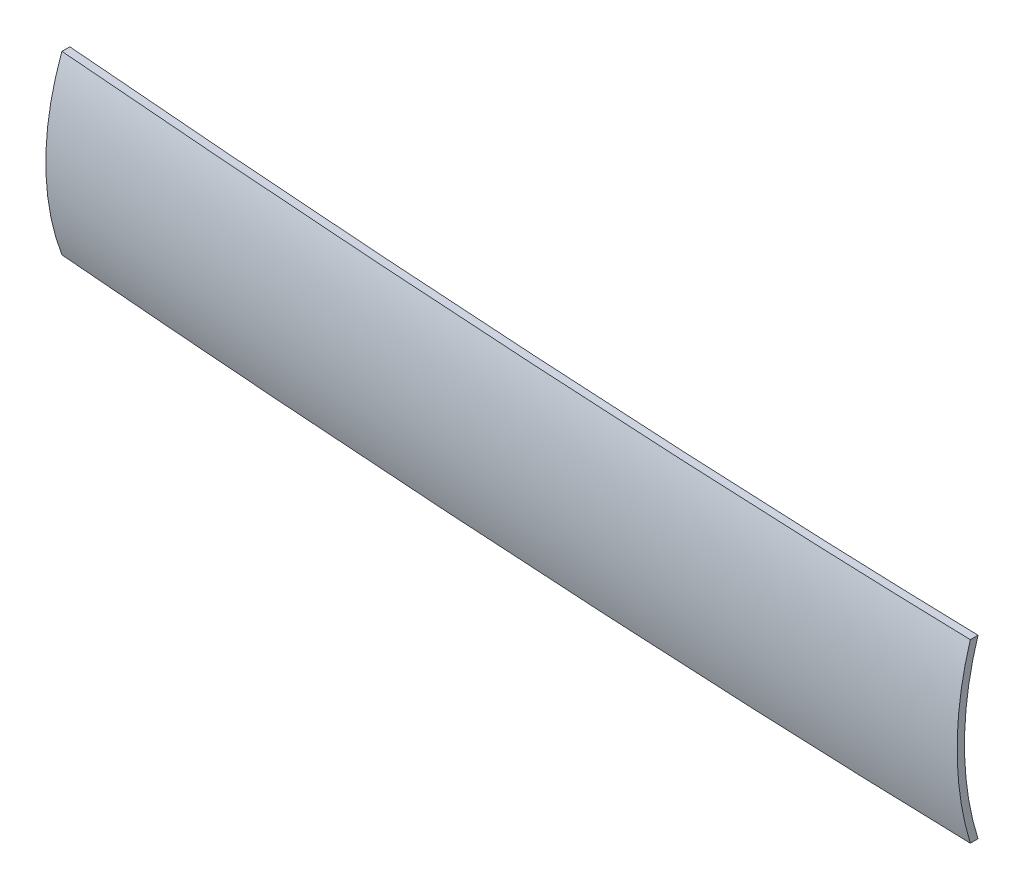
ISO-10303-21;
HEADER;
FILE_DESCRIPTION(('STEP AP214'),'2;1');
FILE_NAME('part.step','',(''),(''),'','','');
FILE_SCHEMA(('AUTOMOTIVE_DESIGN { 1 0 10303 214 1 1 1 1 }'));
ENDSEC;
DATA;
#1=APPLICATION_CONTEXT('core data for automotive mechanical design processes');
#2=APPLICATION_PROTOCOL_DEFINITION('international standard','automotive_design',2000,#1);
#3=PRODUCT_CONTEXT('',#1,'mechanical');
#4=PRODUCT('Part','Part','',(#3));
#5=PRODUCT_RELATED_PRODUCT_CATEGORY('part','',(#4));
#6=PRODUCT_DEFINITION_FORMATION('','',#4);
#7=PRODUCT_DEFINITION_CONTEXT('part definition',#1,'design');
#8=PRODUCT_DEFINITION('design','',#6,#7);
#9=PRODUCT_DEFINITION_SHAPE('','',#8);
#10=(LENGTH_UNIT() NAMED_UNIT(*) SI_UNIT(.MILLI.,.METRE.));
#11=(NAMED_UNIT(*) PLANE_ANGLE_UNIT() SI_UNIT($,.RADIAN.));
#12=(NAMED_UNIT(*) SI_UNIT($,.STERADIAN.) SOLID_ANGLE_UNIT());
#13=UNCERTAINTY_MEASURE_WITH_UNIT(LENGTH_MEASURE(1.E-05),#10,'distance_accuracy_value','');
#14=(GEOMETRIC_REPRESENTATION_CONTEXT(3) GLOBAL_UNCERTAINTY_ASSIGNED_CONTEXT((#13)) GLOBAL_UNIT_ASSIGNED_CONTEXT((#10,
#11,#12)) REPRESENTATION_CONTEXT('',''));
#15=CARTESIAN_POINT('',(0.,0.,0.));
#16=DIRECTION('',(0.,0.,1.));
#17=DIRECTION('',(1.,0.,0.));
#18=AXIS2_PLACEMENT_3D('',#15,#16,#17);
#19=CARTESIAN_POINT('',(406.4,-19.05,-65.415));
#20=DIRECTION('',(0.,-1.,0.));
#21=DIRECTION('',(0.,0.,-1.));
#22=AXIS2_PLACEMENT_3D('',#19,#20,#21);
#23=PLANE('',#22);
#24=DIRECTION('',(0.,0.,1.));
#25=VECTOR('',#24,1.);
#26=CARTESIAN_POINT('',(614.68,-19.05,-65.415));
#27=LINE('',#26,#25);
#28=CARTESIAN_POINT('',(614.68,-19.05,60.5768706545498));
#29=VERTEX_POINT('',#28);
#30=CARTESIAN_POINT('',(614.68,-19.05,62.2394634164212));
#31=VERTEX_POINT('',#30);
#32=EDGE_CURVE('E82',#29,#31,#27,.T.);
#33=ORIENTED_EDGE('',*,*,#32,.T.);
#34=CARTESIAN_POINT('',(614.68,-19.05,62.2394634164212));
#35=CARTESIAN_POINT('',(613.632020687048,-19.05,62.214036244445));
#36=CARTESIAN_POINT('',(612.584065275247,-19.05,62.1876407135079));
#37=CARTESIAN_POINT('',(610.488201738093,-19.05,62.133050106058));
#38=CARTESIAN_POINT('',(609.440293612721,-19.05,62.104855030323));
#39=CARTESIAN_POINT('',(606.296642502465,-19.05,62.0177763337339));
#40=CARTESIAN_POINT('',(604.200968314201,-19.05,61.9563991338882));
#41=CARTESIAN_POINT('',(600.009890101021,-19.05,61.8276867697237));
#42=CARTESIAN_POINT('',(597.914486068537,-19.05,61.7603518507096));
#43=CARTESIAN_POINT('',(593.723861333019,-19.05,61.6201826347736));
#44=CARTESIAN_POINT('',(591.628640630094,-19.05,61.5473483346516));
#45=CARTESIAN_POINT('',(585.343330166874,-19.05,61.321240195689));
#46=CARTESIAN_POINT('',(581.153512665783,-19.05,61.1603586471973));
#47=CARTESIAN_POINT('',(572.77463031861,-19.05,60.8207552047305));
#48=CARTESIAN_POINT('',(568.585565468283,-19.05,60.6420334147609));
#49=CARTESIAN_POINT('',(560.2081584473,-19.05,60.2683996980428));
#50=CARTESIAN_POINT('',(556.019816276736,-19.05,60.0734877692279));
#51=CARTESIAN_POINT('',(547.644715412293,-19.05,59.6686940681309));
#52=CARTESIAN_POINT('',(543.457956569752,-19.05,59.4588153655638));
#53=CARTESIAN_POINT('',(535.085138225165,-19.05,59.0250347291512));
#54=CARTESIAN_POINT('',(530.899078727991,-19.05,58.8011327013992));
#55=CARTESIAN_POINT('',(522.527669629884,-19.05,58.3400535932044));
#56=CARTESIAN_POINT('',(518.342320032775,-19.05,58.1028764434133));
#57=CARTESIAN_POINT('',(509.972351894087,-19.05,57.615812857948));
#58=CARTESIAN_POINT('',(505.78773335411,-19.05,57.3659263947442));
#59=CARTESIAN_POINT('',(497.419253239158,-19.05,56.8539216701874));
#60=CARTESIAN_POINT('',(493.235391662686,-19.05,56.591803433281));
#61=CARTESIAN_POINT('',(485.60612882814,-19.05,56.1029780609362));
#62=CARTESIAN_POINT('',(482.160605255571,-19.05,55.878177096033));
#63=CARTESIAN_POINT('',(475.270097743252,-19.05,55.4206970524878));
#64=CARTESIAN_POINT('',(471.825113800987,-19.05,55.1880180117272));
#65=CARTESIAN_POINT('',(464.935687943614,-19.05,54.7149184550147));
#66=CARTESIAN_POINT('',(461.491246026927,-19.05,54.4744979620597));
#67=CARTESIAN_POINT('',(454.602908289123,-19.05,53.9860238002467));
#68=CARTESIAN_POINT('',(451.159012467263,-19.05,53.7379701418536));
#69=CARTESIAN_POINT('',(444.27131528883,-19.05,53.2342756420037));
#70=CARTESIAN_POINT('',(440.827514005733,-19.05,52.9786337958801));
#71=CARTESIAN_POINT('',(433.940471253465,-19.05,52.459846870631));
#72=CARTESIAN_POINT('',(430.497229785179,-19.05,52.1967017797633));
#73=CARTESIAN_POINT('',(423.611315864817,-19.05,51.6629419845352));
#74=CARTESIAN_POINT('',(420.168643414414,-19.05,51.392327258606));
#75=CARTESIAN_POINT('',(413.283878888479,-19.05,50.8436341460751));
#76=CARTESIAN_POINT('',(409.841786815429,-19.05,50.5655557283403));
#77=CARTESIAN_POINT('',(406.4,-19.05,50.2837492063503));
#78=B_SPLINE_CURVE_WITH_KNOTS('',3,(#34,#35,#36,#37,#38,#39,#40,#41,#42,#43,#44,#45,#46,#47,#48,
#49,#50,#51,#52,#53,#54,#55,#56,#57,#58,#59,#60,#61,#62,#63,#64,#65,#66,#67,#68,#69,#70,#71,#72,
#73,#74,#75,#76,#77),.UNSPECIFIED.,.F.,.F.,(4,2,2,2,2,2,2,2,2,2,2,2,2,2,2,2,2,2,2,2,2,4),(0.,
3.14486209741887,6.28972283554794,12.5794309001224,18.8688801110668,25.1583329819682,
37.7370004520539,50.3155945949234,62.8941903431429,75.470213575569,88.0463210316286,
100.622494190486,113.198694591667,125.774869858807,136.133408896211,146.491898132058,
156.850356599587,167.208800866531,177.568622750606,187.928460848222,198.288328863373,
208.648240099002),.UNSPECIFIED.);
#79=CARTESIAN_POINT('',(406.4,-19.05,50.2837492063503));
#80=VERTEX_POINT('',#79);
#81=EDGE_CURVE('E11',#31,#80,#78,.T.);
#82=ORIENTED_EDGE('',*,*,#81,.T.);
#83=DIRECTION('',(0.,0.,1.));
#84=VECTOR('',#83,1.);
#85=CARTESIAN_POINT('',(406.4,-19.05,-65.415));
#86=LINE('',#85,#84);
#87=CARTESIAN_POINT('',(406.4,-19.05,48.5774275828823));
#88=VERTEX_POINT('',#87);
#89=EDGE_CURVE('E90',#88,#80,#86,.T.);
#90=ORIENTED_EDGE('',*,*,#89,.F.);
#91=CARTESIAN_POINT('',(614.68,-19.05,60.5768706545498));
#92=CARTESIAN_POINT('',(613.658525153747,-19.05,60.5520054828338));
#93=CARTESIAN_POINT('',(612.637073137441,-19.05,60.5262178022497));
#94=CARTESIAN_POINT('',(610.594214280062,-19.05,60.472925431823));
#95=CARTESIAN_POINT('',(609.572807438969,-19.05,60.4454207426845));
#96=CARTESIAN_POINT('',(606.508656830732,-19.05,60.3605232577832));
#97=CARTESIAN_POINT('',(604.465978842236,-19.05,60.3007469428082));
#98=CARTESIAN_POINT('',(600.380880037466,-19.05,60.175492927348));
#99=CARTESIAN_POINT('',(598.338459214183,-19.05,60.1100154543978));
#100=CARTESIAN_POINT('',(594.253792821127,-19.05,59.9737888259074));
#101=CARTESIAN_POINT('',(592.21154725145,-19.05,59.903039667461));
#102=CARTESIAN_POINT('',(586.085146477961,-19.05,59.6834921809249));
#103=CARTESIAN_POINT('',(582.001251604711,-19.05,59.5273914931145));
#104=CARTESIAN_POINT('',(573.834181974489,-19.05,59.1980385427054));
#105=CARTESIAN_POINT('',(569.751007213493,-19.05,59.0247863792102));
#106=CARTESIAN_POINT('',(561.58534877853,-19.05,58.6627154292998));
#107=CARTESIAN_POINT('',(557.5028651046,-19.05,58.4738966420443));
#108=CARTESIAN_POINT('',(549.339420819803,-19.05,58.0818524074824));
#109=CARTESIAN_POINT('',(545.258460067966,-19.05,57.8786298899177));
#110=CARTESIAN_POINT('',(537.097207730964,-19.05,57.458678545053));
#111=CARTESIAN_POINT('',(533.016916150341,-19.05,57.241949629584));
#112=CARTESIAN_POINT('',(524.857011334751,-19.05,56.7957120412282));
#113=CARTESIAN_POINT('',(520.777398103404,-19.05,56.5662033021951));
#114=CARTESIAN_POINT('',(512.618869670604,-19.05,56.0949491889942));
#115=CARTESIAN_POINT('',(508.539954470759,-19.05,55.8532037869966));
#116=CARTESIAN_POINT('',(500.382846603453,-19.05,55.3579319169673));
#117=CARTESIAN_POINT('',(496.304653934773,-19.05,55.104405469002));
#118=CARTESIAN_POINT('',(488.648588095854,-19.05,54.6176980243986));
#119=CARTESIAN_POINT('',(485.070631374668,-19.05,54.3858297948258));
#120=CARTESIAN_POINT('',(477.915302390931,-19.05,53.9134973036788));
#121=CARTESIAN_POINT('',(474.337930125694,-19.05,53.6730330828071));
#122=CARTESIAN_POINT('',(467.183773458258,-19.05,53.1836644565928));
#123=CARTESIAN_POINT('',(463.60698905439,-19.05,52.9347600756358));
#124=CARTESIAN_POINT('',(456.454013546056,-19.05,52.4286343329441));
#125=CARTESIAN_POINT('',(452.877822440813,-19.05,52.171412982174));
#126=CARTESIAN_POINT('',(445.725538754157,-19.05,51.6487055786407));
#127=CARTESIAN_POINT('',(442.149446257317,-19.05,51.3832183687582));
#128=CARTESIAN_POINT('',(434.997872117495,-19.05,50.8440694836786));
#129=CARTESIAN_POINT('',(431.422390475446,-19.05,50.5704077961088));
#130=CARTESIAN_POINT('',(424.272049759305,-19.05,50.0149426914));
#131=CARTESIAN_POINT('',(420.697190686958,-19.05,49.7331392518065));
#132=CARTESIAN_POINT('',(413.548109446852,-19.05,49.16139000941));
#133=CARTESIAN_POINT('',(409.973887281679,-19.05,48.8714441742827));
#134=CARTESIAN_POINT('',(406.4,-19.05,48.5774275828824));
#135=B_SPLINE_CURVE_WITH_KNOTS('',3,(#91,#92,#93,#94,#95,#96,#97,#98,#99,#100,#101,#102,#103,
#104,#105,#106,#107,#108,#109,#110,#111,#112,#113,#114,#115,#116,#117,#118,#119,#120,#121,#122,
#123,#124,#125,#126,#127,#128,#129,#130,#131,#132,#133,#134),.UNSPECIFIED.,.F.,.F.,(4,2,2,2,2,2,
2,2,2,2,2,2,2,2,2,2,2,2,2,2,2,4),(0.,3.06533128805216,6.1306613188844,12.2613089676794,
18.3917120526988,24.522118517401,36.7827045249458,49.0432196933219,61.3037355235438,
73.5617646626702,85.8198738299812,98.078046449183,110.336246948336,122.594426568979,
133.350802059805,144.107126625465,154.863420116259,165.619699427205,176.377491316628,
187.135299489779,197.893137335174,208.651017893859),.UNSPECIFIED.);
#136=EDGE_CURVE('E93',#29,#88,#135,.T.);
#137=ORIENTED_EDGE('',*,*,#136,.F.);
#138=EDGE_LOOP('',(#33,#82,#90,#137));
#139=FACE_BOUND('',#138,.T.);
#140=ADVANCED_FACE('F40',(#139),#23,.T.);
#141=CARTESIAN_POINT('',(614.68,-19.05,-65.415));
#142=DIRECTION('',(1.,0.,0.));
#143=DIRECTION('',(0.,0.,-1.));
#144=AXIS2_PLACEMENT_3D('',#141,#142,#143);
#145=PLANE('',#144);
#146=DIRECTION('',(0.,0.,1.));
#147=VECTOR('',#146,1.);
#148=CARTESIAN_POINT('',(614.68,19.05,-65.415));
#149=LINE('',#148,#147);
#150=CARTESIAN_POINT('',(614.68,19.05,60.5768706545498));
#151=VERTEX_POINT('',#150);
#152=CARTESIAN_POINT('',(614.68,19.05,62.2394634164212));
#153=VERTEX_POINT('',#152);
#154=EDGE_CURVE('E58',#151,#153,#149,.T.);
#155=ORIENTED_EDGE('',*,*,#154,.T.);
#156=CARTESIAN_POINT('',(614.68,0.,0.));
#157=DIRECTION('',(-1.,0.,0.));
#158=DIRECTION('',(0.,0.,1.));
#159=AXIS2_PLACEMENT_3D('',#156,#157,#158);
#160=CIRCLE('',#159,65.0895790919255);
#161=EDGE_CURVE('E44',#153,#31,#160,.F.);
#162=ORIENTED_EDGE('',*,*,#161,.T.);
#163=ORIENTED_EDGE('',*,*,#32,.F.);
#164=CARTESIAN_POINT('',(614.68,0.,0.));
#165=DIRECTION('',(-1.,0.,0.));
#166=DIRECTION('',(0.,0.,1.));
#167=AXIS2_PLACEMENT_3D('',#164,#165,#166);
#168=CIRCLE('',#167,63.5016516186631);
#169=EDGE_CURVE('E85',#151,#29,#168,.F.);
#170=ORIENTED_EDGE('',*,*,#169,.F.);
#171=EDGE_LOOP('',(#155,#162,#163,#170));
#172=FACE_BOUND('',#171,.T.);
#173=ADVANCED_FACE('F42',(#172),#145,.T.);
#174=CARTESIAN_POINT('',(406.4,-19.05,-65.415));
#175=DIRECTION('',(-1.,0.,0.));
#176=DIRECTION('',(0.,0.,1.));
#177=AXIS2_PLACEMENT_3D('',#174,#175,#176);
#178=PLANE('',#177);
#179=ORIENTED_EDGE('',*,*,#89,.T.);
#180=CARTESIAN_POINT('',(406.4,0.,0.));
#181=DIRECTION('',(-1.,0.,0.));
#182=DIRECTION('',(0.,0.,1.));
#183=AXIS2_PLACEMENT_3D('',#180,#181,#182);
#184=CIRCLE('',#183,53.7713486370496);
#185=CARTESIAN_POINT('',(406.4,19.05,50.2837492063503));
#186=VERTEX_POINT('',#185);
#187=EDGE_CURVE('E50',#80,#186,#184,.T.);
#188=ORIENTED_EDGE('',*,*,#187,.T.);
#189=DIRECTION('',(0.,0.,1.));
#190=VECTOR('',#189,1.);
#191=CARTESIAN_POINT('',(406.4,19.05,-65.415));
#192=LINE('',#191,#190);
#193=CARTESIAN_POINT('',(406.4,19.05,48.5774275828823));
#194=VERTEX_POINT('',#193);
#195=EDGE_CURVE('E65',#194,#186,#192,.T.);
#196=ORIENTED_EDGE('',*,*,#195,.F.);
#197=CARTESIAN_POINT('',(406.4,0.,0.));
#198=DIRECTION('',(-1.,0.,0.));
#199=DIRECTION('',(0.,0.,1.));
#200=AXIS2_PLACEMENT_3D('',#197,#198,#199);
#201=CIRCLE('',#200,52.1792005551079);
#202=EDGE_CURVE('E98',#88,#194,#201,.T.);
#203=ORIENTED_EDGE('',*,*,#202,.F.);
#204=EDGE_LOOP('',(#179,#188,#196,#203));
#205=FACE_BOUND('',#204,.T.);
#206=ADVANCED_FACE('F135',(#205),#178,.T.);
#207=CARTESIAN_POINT('',(406.4,19.05,-65.415));
#208=DIRECTION('',(0.,1.,0.));
#209=DIRECTION('',(0.,0.,1.));
#210=AXIS2_PLACEMENT_3D('',#207,#208,#209);
#211=PLANE('',#210);
#212=ORIENTED_EDGE('',*,*,#195,.T.);
#213=CARTESIAN_POINT('',(406.4,19.05,50.2837492063503));
#214=CARTESIAN_POINT('',(410.539542464155,19.05,50.6226829481741));
#215=CARTESIAN_POINT('',(414.679526113682,19.05,50.9562288589561));
#216=CARTESIAN_POINT('',(422.960341576528,19.05,51.6125231715276));
#217=CARTESIAN_POINT('',(427.10117338829,19.05,51.9352715929658));
#218=CARTESIAN_POINT('',(435.383659968395,19.05,52.5699498487934));
#219=CARTESIAN_POINT('',(439.525314735524,19.05,52.8818796990317));
#220=CARTESIAN_POINT('',(447.809426327947,19.05,53.4948438187386));
#221=CARTESIAN_POINT('',(451.951883152423,19.05,53.7958780992536));
#222=CARTESIAN_POINT('',(460.236894044789,19.05,54.3868791235326));
#223=CARTESIAN_POINT('',(464.379447981976,19.05,54.6768476992761));
#224=CARTESIAN_POINT('',(472.665328059643,19.05,55.2455849843043));
#225=CARTESIAN_POINT('',(476.808654200722,19.05,55.5243536848557));
#226=CARTESIAN_POINT('',(485.096069349685,19.05,56.0704493116028));
#227=CARTESIAN_POINT('',(489.240158359148,19.05,56.337776213828));
#228=CARTESIAN_POINT('',(497.529094544664,19.05,56.8606813836457));
#229=CARTESIAN_POINT('',(501.673941723656,19.05,57.1162596046789));
#230=CARTESIAN_POINT('',(509.444770114893,19.05,57.5839897919508));
#231=CARTESIAN_POINT('',(513.070665423664,19.05,57.7975694615786));
#232=CARTESIAN_POINT('',(520.32301261977,19.05,58.2151063646099));
#233=CARTESIAN_POINT('',(523.949464507435,19.05,58.4190635923012));
#234=CARTESIAN_POINT('',(531.202907850831,19.05,58.8169768936105));
#235=CARTESIAN_POINT('',(534.829899305139,19.05,59.0109329931662));
#236=CARTESIAN_POINT('',(542.084410983741,19.05,59.3883553188462));
#237=CARTESIAN_POINT('',(545.711931205403,19.05,59.5718215955193));
#238=CARTESIAN_POINT('',(552.967496506371,19.05,59.9276446226852));
#239=CARTESIAN_POINT('',(556.595541582585,19.05,60.1000014361736));
#240=CARTESIAN_POINT('',(563.852840981747,19.05,60.4329065048305));
#241=CARTESIAN_POINT('',(567.482095404448,19.05,60.5934525893305));
#242=CARTESIAN_POINT('',(574.741148088718,19.05,60.9017803526916));
#243=CARTESIAN_POINT('',(578.37094635041,19.05,61.0495620286228));
#244=CARTESIAN_POINT('',(585.63111125534,19.05,61.3310705790823));
#245=CARTESIAN_POINT('',(589.261477901576,19.05,61.4647973767744));
#246=CARTESIAN_POINT('',(594.707467653576,19.05,61.6534922567347));
#247=CARTESIAN_POINT('',(596.522885726202,19.05,61.7144084471224));
#248=CARTESIAN_POINT('',(600.153859759322,19.05,61.8319711435379));
#249=CARTESIAN_POINT('',(601.969415719759,19.05,61.8886176513539));
#250=CARTESIAN_POINT('',(605.600726822052,19.05,61.9973361425708));
#251=CARTESIAN_POINT('',(607.416481968579,19.05,62.0494079705753));
#252=CARTESIAN_POINT('',(611.048134464273,19.05,62.148421598409));
#253=CARTESIAN_POINT('',(612.86403181364,19.05,62.1953633909044));
#254=CARTESIAN_POINT('',(614.68,19.05,62.2394634164212));
#255=B_SPLINE_CURVE_WITH_KNOTS('',3,(#213,#214,#215,#216,#217,#218,#219,#220,#221,#222,#223,
#224,#225,#226,#227,#228,#229,#230,#231,#232,#233,#234,#235,#236,#237,#238,#239,#240,#241,#242,
#243,#244,#245,#246,#247,#248,#249,#250,#251,#252,#253,#254),.UNSPECIFIED.,.F.,.F.,(4,2,2,2,2,2,
2,2,2,2,2,2,2,2,2,2,2,2,2,2,4),(0.,12.4601807734844,24.9203388714098,37.3804787147467,
49.8406059250801,62.2986612737805,74.7567263366972,87.2148174981417,99.6729580260282,
110.569486602616,121.466021647749,132.362528431389,143.258982701972,154.155375179455,
165.053765304179,175.952157930458,186.850610133647,192.299925424383,197.749238432925,
203.198736476718,208.648242311034),.UNSPECIFIED.);
#256=EDGE_CURVE('E107',#186,#153,#255,.T.);
#257=ORIENTED_EDGE('',*,*,#256,.T.);
#258=ORIENTED_EDGE('',*,*,#154,.F.);
#259=CARTESIAN_POINT('',(406.4,19.05,48.5774275828823));
#260=CARTESIAN_POINT('',(410.406731211885,19.05,48.9070511270945));
#261=CARTESIAN_POINT('',(414.413883092418,19.05,49.2315612613458));
#262=CARTESIAN_POINT('',(422.428992190391,19.05,49.8703482257868));
#263=CARTESIAN_POINT('',(426.436949405761,19.05,50.1846250819417));
#264=CARTESIAN_POINT('',(434.453645943679,19.05,50.8029400955674));
#265=CARTESIAN_POINT('',(438.462385264737,19.05,51.106978272358));
#266=CARTESIAN_POINT('',(446.480626802925,19.05,51.7047590408526));
#267=CARTESIAN_POINT('',(450.490129019154,19.05,51.9985016446431));
#268=CARTESIAN_POINT('',(458.509234087274,19.05,52.575547814306));
#269=CARTESIAN_POINT('',(462.51883681844,19.05,52.8588530576529));
#270=CARTESIAN_POINT('',(470.538777204146,19.05,53.4149220498701));
#271=CARTESIAN_POINT('',(474.549114859387,19.05,53.6876857886505));
#272=CARTESIAN_POINT('',(482.570516234897,19.05,54.222467374196));
#273=CARTESIAN_POINT('',(486.58157995685,19.05,54.484485195711));
#274=CARTESIAN_POINT('',(494.604428368125,19.05,54.9975169828911));
#275=CARTESIAN_POINT('',(498.61621306041,19.05,55.2485309022493));
#276=CARTESIAN_POINT('',(506.360109558018,19.05,55.722071094159));
#277=CARTESIAN_POINT('',(510.092174585134,19.05,55.9453623306837));
#278=CARTESIAN_POINT('',(517.556901555982,19.05,56.3817944548361));
#279=CARTESIAN_POINT('',(521.289563500201,19.05,56.5949353341447));
#280=CARTESIAN_POINT('',(528.755465318956,19.05,57.0106740678875));
#281=CARTESIAN_POINT('',(532.488705191994,19.05,57.2132719491959));
#282=CARTESIAN_POINT('',(539.955749918477,19.05,57.6074255931769));
#283=CARTESIAN_POINT('',(543.689554769044,19.05,57.7989814103001));
#284=CARTESIAN_POINT('',(551.157724500084,19.05,58.1704032828862));
#285=CARTESIAN_POINT('',(554.892089377127,19.05,58.3502694072316));
#286=CARTESIAN_POINT('',(562.362107454509,19.05,58.6975678178263));
#287=CARTESIAN_POINT('',(566.097760764887,19.05,58.8649977416121));
#288=CARTESIAN_POINT('',(573.569646761775,19.05,59.1864251922236));
#289=CARTESIAN_POINT('',(577.305879448384,19.05,59.3404227167236));
#290=CARTESIAN_POINT('',(584.77894993156,19.05,59.6336232970257));
#291=CARTESIAN_POINT('',(588.515787731376,19.05,59.7728262705115));
#292=CARTESIAN_POINT('',(594.121512836712,19.05,59.9690918266358));
#293=CARTESIAN_POINT('',(595.990181754321,19.05,60.0324243441996));
#294=CARTESIAN_POINT('',(599.727666430951,19.05,60.1545844731997));
#295=CARTESIAN_POINT('',(601.596482189906,19.05,60.2134120866614));
#296=CARTESIAN_POINT('',(605.334326878046,19.05,60.3262207342238));
#297=CARTESIAN_POINT('',(607.203355812439,19.05,60.3802015965058));
#298=CARTESIAN_POINT('',(610.007011216629,19.05,60.4571323945402));
#299=CARTESIAN_POINT('',(610.941582462833,19.05,60.4821025970836));
#300=CARTESIAN_POINT('',(612.810762774174,19.05,60.5305964601055));
#301=CARTESIAN_POINT('',(613.745371839324,19.05,60.5541201200957));
#302=CARTESIAN_POINT('',(614.68,19.05,60.5768706545498));
#303=B_SPLINE_CURVE_WITH_KNOTS('',3,(#259,#260,#261,#262,#263,#264,#265,#266,#267,#268,#269,
#270,#271,#272,#273,#274,#275,#276,#277,#278,#279,#280,#281,#282,#283,#284,#285,#286,#287,#288,
#289,#290,#291,#292,#293,#294,#295,#296,#297,#298,#299,#300,#301,#302),.UNSPECIFIED.,.F.,.F.,(4,
2,2,2,2,2,2,2,2,2,2,2,2,2,2,2,2,2,2,2,2,4),(0.,12.0607976990462,24.1215647934893,
36.1823091286094,48.2430393045731,60.3018225688419,72.3606173751294,84.4194405147963,
96.4783143957146,107.694517827215,118.910730451233,130.126914483659,141.343043202266,
152.55910582289,163.7772937009,174.995483521227,186.213735755964,191.822956806014,
197.43217533419,203.041592632329,205.846305949028,208.651020212469),.UNSPECIFIED.);
#304=EDGE_CURVE('E102',#194,#151,#303,.T.);
#305=ORIENTED_EDGE('',*,*,#304,.F.);
#306=EDGE_LOOP('',(#212,#257,#258,#305));
#307=FACE_BOUND('',#306,.T.);
#308=ADVANCED_FACE('F147',(#307),#211,.T.);
#309=CARTESIAN_POINT('',(635.,65.405,0.));
#310=CARTESIAN_POINT('',(632.980968041376,65.3999049079982,0.));
#311=CARTESIAN_POINT('',(628.943051518666,65.3607987649682,0.));
#312=CARTESIAN_POINT('',(620.867800743739,65.238425835158,0.));
#313=CARTESIAN_POINT('',(607.876612197197,64.9420444267635,0.));
#314=CARTESIAN_POINT('',(591.989866173885,64.4665825864284,0.));
#315=CARTESIAN_POINT('',(568.294487812533,63.5924578117391,0.));
#316=CARTESIAN_POINT('',(538.814064527861,62.2664605978091,0.));
#317=CARTESIAN_POINT('',(504.434100625351,60.4361863708921,0.));
#318=CARTESIAN_POINT('',(465.161890456531,58.0127528854532,0.));
#319=CARTESIAN_POINT('',(425.909385737502,55.2895252497301,0.));
#320=CARTESIAN_POINT('',(386.677550901074,52.2836135264071,0.));
#321=CARTESIAN_POINT('',(347.46776242828,49.0025673324941,0.));
#322=CARTESIAN_POINT('',(308.282068325667,45.4454012222465,0.));
#323=CARTESIAN_POINT('',(269.123174714222,41.6037605555624,0.));
#324=CARTESIAN_POINT('',(229.995170684784,37.4592339547084,0.));
#325=CARTESIAN_POINT('',(190.90356887878,32.9826992551564,0.));
#326=CARTESIAN_POINT('',(151.857530337521,28.1241973222402,0.));
#327=CARTESIAN_POINT('',(112.870807325211,22.8061369351955,0.));
#328=CARTESIAN_POINT('',(77.9573287846358,17.4873019784259,0.));
#329=CARTESIAN_POINT('',(49.1787935546804,12.5135793040533,0.));
#330=CARTESIAN_POINT('',(28.2617417770008,8.30499279351691,0.));
#331=CARTESIAN_POINT('',(16.0220282949449,5.44625020056791,0.));
#332=CARTESIAN_POINT('',(8.93318062814798,3.51548578780447,0.));
#333=CARTESIAN_POINT('',(5.34723088355805,2.386292140167,0.));
#334=CARTESIAN_POINT('',(3.6596293922744,1.78691850190998,0.));
#335=CARTESIAN_POINT('',(2.98645416155403,1.52966839929743,0.));
#336=CARTESIAN_POINT('',(2.85848234221888,1.48002014769658,0.));
#337=B_SPLINE_CURVE_WITH_KNOTS('',4,(#309,#310,#311,#312,#313,#314,#315,#316,#317,#318,#319,
#320,#321,#322,#323,#324,#325,#326,#327,#328,#329,#330,#331,#332,#333,#334,#335,#336),
.UNSPECIFIED.,.F.,.F.,(5,1,1,1,1,1,1,1,1,1,1,1,1,1,1,1,1,1,1,1,1,1,1,1,5),(0.,
0.0126278600836156,0.0252557201672313,0.0505114403344626,0.0812725997628029,0.112033759191143,
0.173556078208551,0.235078396298971,0.296600715210933,0.358123034494872,0.419645352372099,
0.481167670690979,0.542689989321029,0.604212308113024,0.665734626856386,0.727256945203041,
0.788779262537685,0.850301578000527,0.911823895791277,0.948128969524394,0.971421118017023,
0.983729988096585,0.990421707276453,0.994070390445943,0.994928897362161),.UNSPECIFIED.);
#338=CARTESIAN_POINT('',(0.,0.,0.));
#339=DIRECTION('',(-1.,0.,0.));
#340=AXIS1_PLACEMENT('',#338,#339);
#341=SURFACE_OF_REVOLUTION('',#337,#340);
#342=OFFSET_SURFACE('',#341,-1.5875,.F.);
#343=ORIENTED_EDGE('',*,*,#304,.T.);
#344=ORIENTED_EDGE('',*,*,#169,.T.);
#345=ORIENTED_EDGE('',*,*,#136,.T.);
#346=ORIENTED_EDGE('',*,*,#202,.T.);
#347=EDGE_LOOP('',(#343,#344,#345,#346));
#348=FACE_BOUND('',#347,.T.);
#349=ADVANCED_FACE('F101',(#348),#342,.F.);
#350=CARTESIAN_POINT('',(635.,65.405,0.));
#351=CARTESIAN_POINT('',(632.980968041376,65.3999049079982,0.));
#352=CARTESIAN_POINT('',(628.943051518666,65.3607987649682,0.));
#353=CARTESIAN_POINT('',(620.867800743739,65.238425835158,0.));
#354=CARTESIAN_POINT('',(607.876612197197,64.9420444267635,0.));
#355=CARTESIAN_POINT('',(591.989866173885,64.4665825864284,0.));
#356=CARTESIAN_POINT('',(568.294487812533,63.5924578117391,0.));
#357=CARTESIAN_POINT('',(538.814064527861,62.2664605978091,0.));
#358=CARTESIAN_POINT('',(504.434100625351,60.4361863708921,0.));
#359=CARTESIAN_POINT('',(465.161890456531,58.0127528854532,0.));
#360=CARTESIAN_POINT('',(425.909385737502,55.2895252497301,0.));
#361=CARTESIAN_POINT('',(386.677550901074,52.2836135264071,0.));
#362=CARTESIAN_POINT('',(347.46776242828,49.0025673324941,0.));
#363=CARTESIAN_POINT('',(308.282068325667,45.4454012222465,0.));
#364=CARTESIAN_POINT('',(269.123174714222,41.6037605555624,0.));
#365=CARTESIAN_POINT('',(229.995170684784,37.4592339547084,0.));
#366=CARTESIAN_POINT('',(190.90356887878,32.9826992551564,0.));
#367=CARTESIAN_POINT('',(151.857530337521,28.1241973222402,0.));
#368=CARTESIAN_POINT('',(112.870807325211,22.8061369351955,0.));
#369=CARTESIAN_POINT('',(77.9573287846358,17.4873019784259,0.));
#370=CARTESIAN_POINT('',(49.1787935546804,12.5135793040533,0.));
#371=CARTESIAN_POINT('',(28.2617417770008,8.30499279351691,0.));
#372=CARTESIAN_POINT('',(16.0220282949449,5.44625020056791,0.));
#373=CARTESIAN_POINT('',(8.93318062814798,3.51548578780447,0.));
#374=CARTESIAN_POINT('',(5.16339541485639,2.32840347516785,0.));
#375=CARTESIAN_POINT('',(3.11582679923173,1.59218900684347,0.));
#376=CARTESIAN_POINT('',(1.97027691704133,1.1275016191836,0.));
#377=CARTESIAN_POINT('',(1.33181141167439,0.839140676757945,0.));
#378=CARTESIAN_POINT('',(0.95671602904962,0.653660621097922,0.));
#379=CARTESIAN_POINT('',(0.715531562152649,0.525146597932932,0.));
#380=CARTESIAN_POINT('',(0.550210431495335,0.431764809009291,0.));
#381=CARTESIAN_POINT('',(0.406270251751136,0.344359984283262,0.));
#382=CARTESIAN_POINT('',(0.283649615611126,0.263361482709997,0.));
#383=CARTESIAN_POINT('',(0.181602895816827,0.18888943286587,0.));
#384=CARTESIAN_POINT('',(0.109817079168359,0.130424863371353,0.));
#385=CARTESIAN_POINT('',(0.0569836765196351,0.0804262546774983,0.));
#386=CARTESIAN_POINT('',(0.0222716682134025,0.0403845586316774,0.));
#387=CARTESIAN_POINT('',(0.00752296936524731,0.0183675987536798,0.));
#388=CARTESIAN_POINT('',(0.00219211488346488,0.0062902080222314,0.));
#389=CARTESIAN_POINT('',(0.,0.,0.));
#390=B_SPLINE_CURVE_WITH_KNOTS('',4,(#350,#351,#352,#353,#354,#355,#356,#357,#358,#359,#360,
#361,#362,#363,#364,#365,#366,#367,#368,#369,#370,#371,#372,#373,#374,#375,#376,#377,#378,#379,
#380,#381,#382,#383,#384,#385,#386,#387,#388,#389),.UNSPECIFIED.,.F.,.F.,(5,1,1,1,1,1,1,1,1,1,1,
1,1,1,1,1,1,1,1,1,1,1,1,1,1,1,1,1,1,1,1,1,1,1,1,1,5),(0.,0.0126278600836156,0.0252557201672313,
0.0505114403344626,0.0812725997628029,0.112033759191143,0.173556078208551,0.235078396298971,
0.296600715210933,0.358123034494872,0.419645352372099,0.481167670690979,0.542689989321029,
0.604212308113024,0.665734626856386,0.727256945203041,0.788779262537685,0.850301578000527,
0.911823895791277,0.948128969524394,0.971421118017023,0.983729988096585,0.990421707276453,
0.994070390445943,0.996134035175531,0.997335608030765,0.998151497389768,0.998451073952135,
0.998750650514502,0.999044750264593,0.999338850014684,0.999504137511013,0.999669425007342,
0.999834712503671,0.999917356251836,0.999958678125918,1.),.UNSPECIFIED.);
#391=CARTESIAN_POINT('',(0.,0.,0.));
#392=DIRECTION('',(-1.,0.,0.));
#393=AXIS1_PLACEMENT('',#391,#392);
#394=SURFACE_OF_REVOLUTION('',#390,#393);
#395=ORIENTED_EDGE('',*,*,#161,.F.);
#396=ORIENTED_EDGE('',*,*,#256,.F.);
#397=ORIENTED_EDGE('',*,*,#187,.F.);
#398=ORIENTED_EDGE('',*,*,#81,.F.);
#399=EDGE_LOOP('',(#395,#396,#397,#398));
#400=FACE_BOUND('',#399,.T.);
#401=ADVANCED_FACE('F128',(#400),#394,.T.);
#402=CLOSED_SHELL('',(#140,#173,#206,#308,#349,#401));
#403=MANIFOLD_SOLID_BREP('B2',#402);
#404=ADVANCED_BREP_SHAPE_REPRESENTATION('',(#18,#403),#14);
#405=SHAPE_DEFINITION_REPRESENTATION(#9,#404);
ENDSEC;
END-ISO-10303-21;
